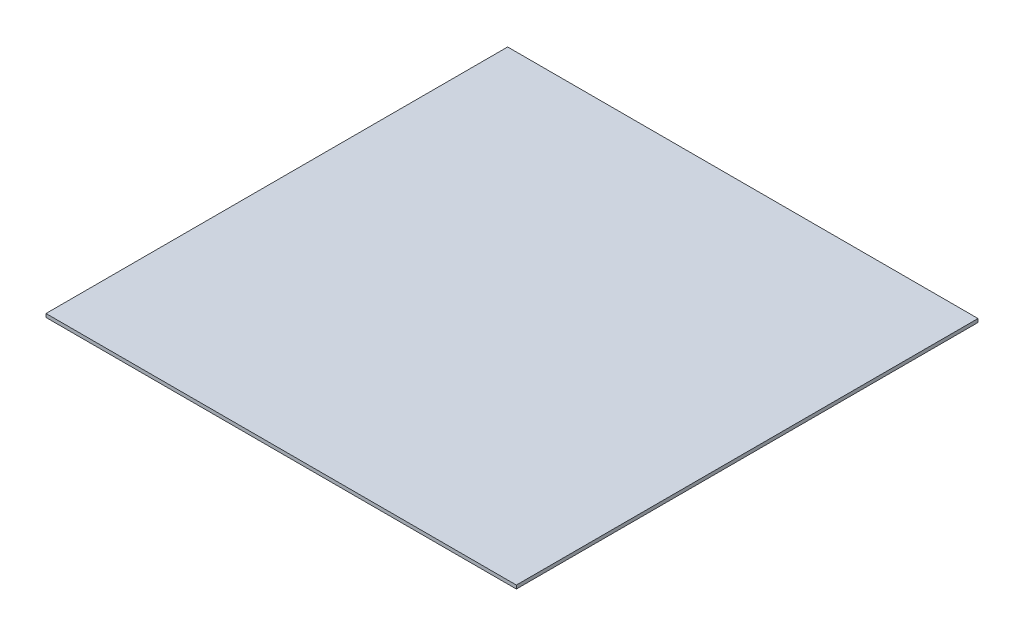
ISO-10303-21;
HEADER;
FILE_DESCRIPTION(('STEP AP214'),'2;1');
FILE_NAME('part.step','',(''),(''),'','','');
FILE_SCHEMA(('AUTOMOTIVE_DESIGN { 1 0 10303 214 1 1 1 1 }'));
ENDSEC;
DATA;
#1=APPLICATION_CONTEXT('core data for automotive mechanical design processes');
#2=APPLICATION_PROTOCOL_DEFINITION('international standard','automotive_design',2000,#1);
#3=PRODUCT_CONTEXT('',#1,'mechanical');
#4=PRODUCT('Part','Part','',(#3));
#5=PRODUCT_RELATED_PRODUCT_CATEGORY('part','',(#4));
#6=PRODUCT_DEFINITION_FORMATION('','',#4);
#7=PRODUCT_DEFINITION_CONTEXT('part definition',#1,'design');
#8=PRODUCT_DEFINITION('design','',#6,#7);
#9=PRODUCT_DEFINITION_SHAPE('','',#8);
#10=(LENGTH_UNIT() NAMED_UNIT(*) SI_UNIT(.MILLI.,.METRE.));
#11=(NAMED_UNIT(*) PLANE_ANGLE_UNIT() SI_UNIT($,.RADIAN.));
#12=(NAMED_UNIT(*) SI_UNIT($,.STERADIAN.) SOLID_ANGLE_UNIT());
#13=UNCERTAINTY_MEASURE_WITH_UNIT(LENGTH_MEASURE(1.E-05),#10,'distance_accuracy_value','');
#14=(GEOMETRIC_REPRESENTATION_CONTEXT(3) GLOBAL_UNCERTAINTY_ASSIGNED_CONTEXT((#13)) GLOBAL_UNIT_ASSIGNED_CONTEXT((#10,
#11,#12)) REPRESENTATION_CONTEXT('',''));
#15=CARTESIAN_POINT('',(0.,0.,0.));
#16=DIRECTION('',(0.,0.,1.));
#17=DIRECTION('',(1.,0.,0.));
#18=AXIS2_PLACEMENT_3D('',#15,#16,#17);
#19=CARTESIAN_POINT('',(0.,5.08,0.));
#20=DIRECTION('',(1.,0.,0.));
#21=DIRECTION('',(0.,0.,-1.));
#22=AXIS2_PLACEMENT_3D('',#19,#20,#21);
#23=PLANE('',#22);
#24=DIRECTION('',(0.,0.,1.));
#25=VECTOR('',#24,1.);
#26=CARTESIAN_POINT('',(0.,0.,0.));
#27=LINE('',#26,#25);
#28=CARTESIAN_POINT('',(0.,0.,0.));
#29=VERTEX_POINT('',#28);
#30=CARTESIAN_POINT('',(0.,0.,673.1));
#31=VERTEX_POINT('',#30);
#32=EDGE_CURVE('E96',#29,#31,#27,.T.);
#33=ORIENTED_EDGE('',*,*,#32,.T.);
#34=DIRECTION('',(0.,-1.,0.));
#35=VECTOR('',#34,1.);
#36=CARTESIAN_POINT('',(0.,5.08,673.1));
#37=LINE('',#36,#35);
#38=CARTESIAN_POINT('',(0.,5.08,673.1));
#39=VERTEX_POINT('',#38);
#40=EDGE_CURVE('E11',#39,#31,#37,.T.);
#41=ORIENTED_EDGE('',*,*,#40,.F.);
#42=DIRECTION('',(0.,0.,1.));
#43=VECTOR('',#42,1.);
#44=CARTESIAN_POINT('',(0.,5.08,0.));
#45=LINE('',#44,#43);
#46=CARTESIAN_POINT('',(0.,5.08,0.));
#47=VERTEX_POINT('',#46);
#48=EDGE_CURVE('E84',#47,#39,#45,.T.);
#49=ORIENTED_EDGE('',*,*,#48,.F.);
#50=DIRECTION('',(0.,-1.,0.));
#51=VECTOR('',#50,1.);
#52=CARTESIAN_POINT('',(0.,5.08,0.));
#53=LINE('',#52,#51);
#54=EDGE_CURVE('E92',#47,#29,#53,.T.);
#55=ORIENTED_EDGE('',*,*,#54,.T.);
#56=EDGE_LOOP('',(#33,#41,#49,#55));
#57=FACE_BOUND('',#56,.T.);
#58=ADVANCED_FACE('F33',(#57),#23,.F.);
#59=CARTESIAN_POINT('',(0.,5.08,673.1));
#60=DIRECTION('',(0.,0.,-1.));
#61=DIRECTION('',(-1.,0.,0.));
#62=AXIS2_PLACEMENT_3D('',#59,#60,#61);
#63=PLANE('',#62);
#64=DIRECTION('',(1.,0.,0.));
#65=VECTOR('',#64,1.);
#66=CARTESIAN_POINT('',(0.,0.,673.1));
#67=LINE('',#66,#65);
#68=CARTESIAN_POINT('',(685.8,0.,673.1));
#69=VERTEX_POINT('',#68);
#70=EDGE_CURVE('E88',#31,#69,#67,.T.);
#71=ORIENTED_EDGE('',*,*,#70,.T.);
#72=DIRECTION('',(0.,-1.,0.));
#73=VECTOR('',#72,1.);
#74=CARTESIAN_POINT('',(685.8,5.08,673.1));
#75=LINE('',#74,#73);
#76=CARTESIAN_POINT('',(685.8,5.08,673.1));
#77=VERTEX_POINT('',#76);
#78=EDGE_CURVE('E41',#77,#69,#75,.T.);
#79=ORIENTED_EDGE('',*,*,#78,.F.);
#80=DIRECTION('',(1.,0.,0.));
#81=VECTOR('',#80,1.);
#82=CARTESIAN_POINT('',(0.,5.08,673.1));
#83=LINE('',#82,#81);
#84=EDGE_CURVE('E79',#39,#77,#83,.T.);
#85=ORIENTED_EDGE('',*,*,#84,.F.);
#86=ORIENTED_EDGE('',*,*,#40,.T.);
#87=EDGE_LOOP('',(#71,#79,#85,#86));
#88=FACE_BOUND('',#87,.T.);
#89=ADVANCED_FACE('F87',(#88),#63,.F.);
#90=CARTESIAN_POINT('',(685.8,5.08,0.));
#91=DIRECTION('',(-1.,0.,0.));
#92=DIRECTION('',(0.,0.,1.));
#93=AXIS2_PLACEMENT_3D('',#90,#91,#92);
#94=PLANE('',#93);
#95=DIRECTION('',(0.,0.,-1.));
#96=VECTOR('',#95,1.);
#97=CARTESIAN_POINT('',(685.8,0.,0.));
#98=LINE('',#97,#96);
#99=CARTESIAN_POINT('',(685.8,0.,0.));
#100=VERTEX_POINT('',#99);
#101=EDGE_CURVE('E66',#69,#100,#98,.T.);
#102=ORIENTED_EDGE('',*,*,#101,.T.);
#103=DIRECTION('',(0.,-1.,0.));
#104=VECTOR('',#103,1.);
#105=CARTESIAN_POINT('',(685.8,5.08,0.));
#106=LINE('',#105,#104);
#107=CARTESIAN_POINT('',(685.8,5.08,0.));
#108=VERTEX_POINT('',#107);
#109=EDGE_CURVE('E89',#108,#100,#106,.T.);
#110=ORIENTED_EDGE('',*,*,#109,.F.);
#111=DIRECTION('',(0.,0.,-1.));
#112=VECTOR('',#111,1.);
#113=CARTESIAN_POINT('',(685.8,5.08,0.));
#114=LINE('',#113,#112);
#115=EDGE_CURVE('E82',#77,#108,#114,.T.);
#116=ORIENTED_EDGE('',*,*,#115,.F.);
#117=ORIENTED_EDGE('',*,*,#78,.T.);
#118=EDGE_LOOP('',(#102,#110,#116,#117));
#119=FACE_BOUND('',#118,.T.);
#120=ADVANCED_FACE('F90',(#119),#94,.F.);
#121=CARTESIAN_POINT('',(0.,5.08,0.));
#122=DIRECTION('',(0.,0.,1.));
#123=DIRECTION('',(1.,0.,0.));
#124=AXIS2_PLACEMENT_3D('',#121,#122,#123);
#125=PLANE('',#124);
#126=DIRECTION('',(-1.,0.,0.));
#127=VECTOR('',#126,1.);
#128=CARTESIAN_POINT('',(0.,0.,0.));
#129=LINE('',#128,#127);
#130=EDGE_CURVE('E72',#100,#29,#129,.T.);
#131=ORIENTED_EDGE('',*,*,#130,.T.);
#132=ORIENTED_EDGE('',*,*,#54,.F.);
#133=DIRECTION('',(-1.,0.,0.));
#134=VECTOR('',#133,1.);
#135=CARTESIAN_POINT('',(0.,5.08,0.));
#136=LINE('',#135,#134);
#137=EDGE_CURVE('E49',#108,#47,#136,.T.);
#138=ORIENTED_EDGE('',*,*,#137,.F.);
#139=ORIENTED_EDGE('',*,*,#109,.T.);
#140=EDGE_LOOP('',(#131,#132,#138,#139));
#141=FACE_BOUND('',#140,.T.);
#142=ADVANCED_FACE('F103',(#141),#125,.F.);
#143=CARTESIAN_POINT('',(0.,5.08,0.));
#144=DIRECTION('',(0.,1.,0.));
#145=DIRECTION('',(0.,0.,1.));
#146=AXIS2_PLACEMENT_3D('',#143,#144,#145);
#147=PLANE('',#146);
#148=ORIENTED_EDGE('',*,*,#48,.T.);
#149=ORIENTED_EDGE('',*,*,#84,.T.);
#150=ORIENTED_EDGE('',*,*,#115,.T.);
#151=ORIENTED_EDGE('',*,*,#137,.T.);
#152=EDGE_LOOP('',(#148,#149,#150,#151));
#153=FACE_BOUND('',#152,.T.);
#154=ADVANCED_FACE('F80',(#153),#147,.T.);
#155=CARTESIAN_POINT('',(0.,0.,0.));
#156=DIRECTION('',(0.,1.,0.));
#157=DIRECTION('',(0.,0.,1.));
#158=AXIS2_PLACEMENT_3D('',#155,#156,#157);
#159=PLANE('',#158);
#160=ORIENTED_EDGE('',*,*,#32,.F.);
#161=ORIENTED_EDGE('',*,*,#130,.F.);
#162=ORIENTED_EDGE('',*,*,#101,.F.);
#163=ORIENTED_EDGE('',*,*,#70,.F.);
#164=EDGE_LOOP('',(#160,#161,#162,#163));
#165=FACE_BOUND('',#164,.T.);
#166=ADVANCED_FACE('F106',(#165),#159,.F.);
#167=CLOSED_SHELL('',(#58,#89,#120,#142,#154,#166));
#168=MANIFOLD_SOLID_BREP('B2',#167);
#169=ADVANCED_BREP_SHAPE_REPRESENTATION('',(#18,#168),#14);
#170=SHAPE_DEFINITION_REPRESENTATION(#9,#169);
ENDSEC;
END-ISO-10303-21;
